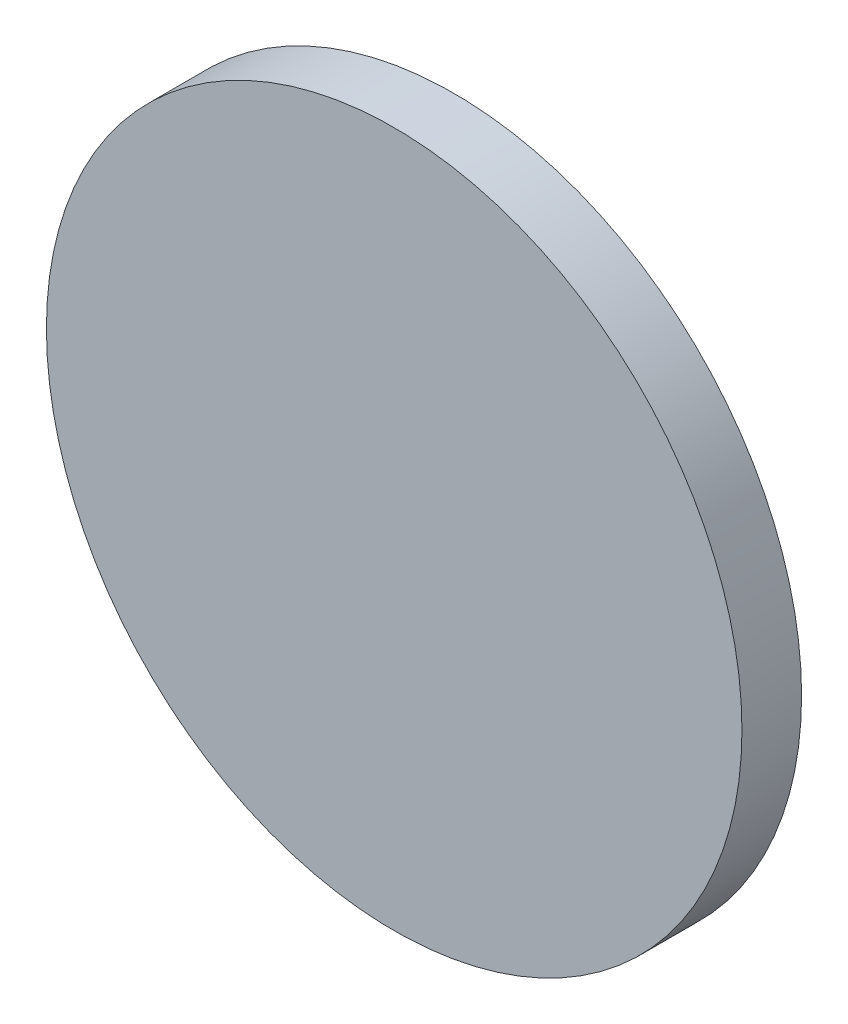
ISO-10303-21;
HEADER;
FILE_DESCRIPTION(('STEP AP214'),'2;1');
FILE_NAME('part.step','',(''),(''),'','','');
FILE_SCHEMA(('AUTOMOTIVE_DESIGN { 1 0 10303 214 1 1 1 1 }'));
ENDSEC;
DATA;
#1=APPLICATION_CONTEXT('core data for automotive mechanical design processes');
#2=APPLICATION_PROTOCOL_DEFINITION('international standard','automotive_design',2000,#1);
#3=PRODUCT_CONTEXT('',#1,'mechanical');
#4=PRODUCT('Part','Part','',(#3));
#5=PRODUCT_RELATED_PRODUCT_CATEGORY('part','',(#4));
#6=PRODUCT_DEFINITION_FORMATION('','',#4);
#7=PRODUCT_DEFINITION_CONTEXT('part definition',#1,'design');
#8=PRODUCT_DEFINITION('design','',#6,#7);
#9=PRODUCT_DEFINITION_SHAPE('','',#8);
#10=(LENGTH_UNIT() NAMED_UNIT(*) SI_UNIT(.MILLI.,.METRE.));
#11=(NAMED_UNIT(*) PLANE_ANGLE_UNIT() SI_UNIT($,.RADIAN.));
#12=(NAMED_UNIT(*) SI_UNIT($,.STERADIAN.) SOLID_ANGLE_UNIT());
#13=UNCERTAINTY_MEASURE_WITH_UNIT(LENGTH_MEASURE(1.E-05),#10,'distance_accuracy_value','');
#14=(GEOMETRIC_REPRESENTATION_CONTEXT(3) GLOBAL_UNCERTAINTY_ASSIGNED_CONTEXT((#13)) GLOBAL_UNIT_ASSIGNED_CONTEXT((#10,
#11,#12)) REPRESENTATION_CONTEXT('',''));
#15=CARTESIAN_POINT('',(0.,0.,0.));
#16=DIRECTION('',(0.,0.,1.));
#17=DIRECTION('',(1.,0.,0.));
#18=AXIS2_PLACEMENT_3D('',#15,#16,#17);
#19=CARTESIAN_POINT('',(5.6388,5.68452,0.76487));
#20=DIRECTION('',(0.,0.,-1.));
#21=DIRECTION('',(-1.,0.,0.));
#22=AXIS2_PLACEMENT_3D('',#19,#20,#21);
#23=PLANE('',#22);
#24=CARTESIAN_POINT('',(5.6388,5.68452,0.76487));
#25=DIRECTION('',(0.,0.,1.));
#26=DIRECTION('',(1.,0.,0.));
#27=AXIS2_PLACEMENT_3D('',#24,#25,#26);
#28=CIRCLE('',#27,0.200024667);
#29=CARTESIAN_POINT('',(5.838824667,5.68452,0.76487));
#30=VERTEX_POINT('',#29);
#31=EDGE_CURVE('E18',#30,#30,#28,.T.);
#32=ORIENTED_EDGE('',*,*,#31,.F.);
#33=EDGE_LOOP('',(#32));
#34=FACE_BOUND('',#33,.T.);
#35=ADVANCED_FACE('F15',(#34),#23,.T.);
#36=CARTESIAN_POINT('',(5.6388,5.68452,0.76487));
#37=DIRECTION('',(0.,0.,1.));
#38=DIRECTION('',(1.,0.,0.));
#39=AXIS2_PLACEMENT_3D('',#36,#37,#38);
#40=CYLINDRICAL_SURFACE('',#39,0.200024667);
#41=CARTESIAN_POINT('',(5.6388,5.68452,0.79916));
#42=DIRECTION('',(0.,0.,1.));
#43=DIRECTION('',(1.,0.,0.));
#44=AXIS2_PLACEMENT_3D('',#41,#42,#43);
#45=CIRCLE('',#44,0.200024667);
#46=CARTESIAN_POINT('',(5.838824667,5.68452,0.79916));
#47=VERTEX_POINT('',#46);
#48=EDGE_CURVE('E10',#47,#47,#45,.T.);
#49=ORIENTED_EDGE('',*,*,#48,.F.);
#50=EDGE_LOOP('',(#49));
#51=FACE_BOUND('',#50,.T.);
#52=ORIENTED_EDGE('',*,*,#31,.T.);
#53=EDGE_LOOP('',(#52));
#54=FACE_BOUND('',#53,.T.);
#55=ADVANCED_FACE('F27',(#51,#54),#40,.T.);
#56=CARTESIAN_POINT('',(5.6388,5.68452,0.79916));
#57=DIRECTION('',(0.,0.,1.));
#58=DIRECTION('',(1.,0.,0.));
#59=AXIS2_PLACEMENT_3D('',#56,#57,#58);
#60=PLANE('',#59);
#61=ORIENTED_EDGE('',*,*,#48,.T.);
#62=EDGE_LOOP('',(#61));
#63=FACE_BOUND('',#62,.T.);
#64=ADVANCED_FACE('F34',(#63),#60,.T.);
#65=CLOSED_SHELL('',(#35,#55,#64));
#66=MANIFOLD_SOLID_BREP('B1',#65);
#67=ADVANCED_BREP_SHAPE_REPRESENTATION('',(#18,#66),#14);
#68=SHAPE_DEFINITION_REPRESENTATION(#9,#67);
ENDSEC;
END-ISO-10303-21;
